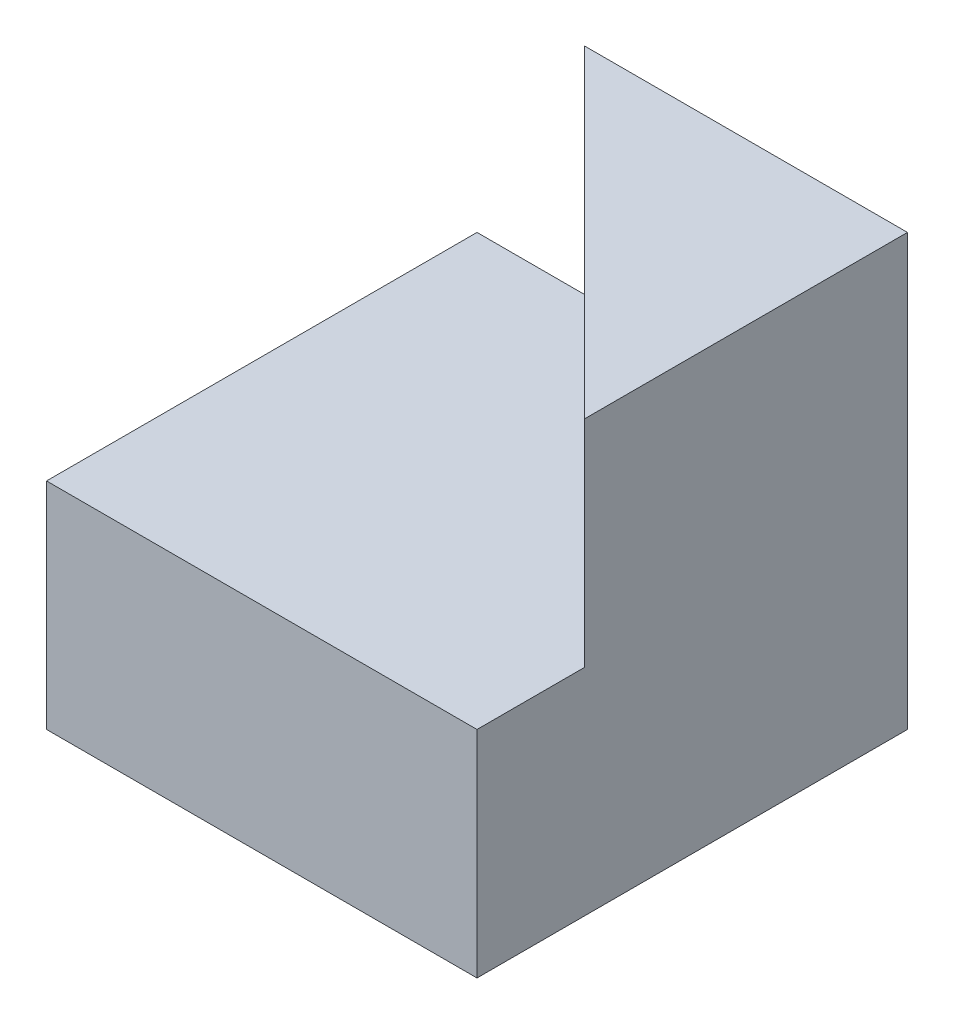
ISO-10303-21;
HEADER;
FILE_DESCRIPTION(('STEP AP214'),'2;1');
FILE_NAME('part.step','',(''),(''),'','','');
FILE_SCHEMA(('AUTOMOTIVE_DESIGN { 1 0 10303 214 1 1 1 1 }'));
ENDSEC;
DATA;
#1=APPLICATION_CONTEXT('core data for automotive mechanical design processes');
#2=APPLICATION_PROTOCOL_DEFINITION('international standard','automotive_design',2000,#1);
#3=PRODUCT_CONTEXT('',#1,'mechanical');
#4=PRODUCT('Part','Part','',(#3));
#5=PRODUCT_RELATED_PRODUCT_CATEGORY('part','',(#4));
#6=PRODUCT_DEFINITION_FORMATION('','',#4);
#7=PRODUCT_DEFINITION_CONTEXT('part definition',#1,'design');
#8=PRODUCT_DEFINITION('design','',#6,#7);
#9=PRODUCT_DEFINITION_SHAPE('','',#8);
#10=(LENGTH_UNIT() NAMED_UNIT(*) SI_UNIT(.MILLI.,.METRE.));
#11=(NAMED_UNIT(*) PLANE_ANGLE_UNIT() SI_UNIT($,.RADIAN.));
#12=(NAMED_UNIT(*) SI_UNIT($,.STERADIAN.) SOLID_ANGLE_UNIT());
#13=UNCERTAINTY_MEASURE_WITH_UNIT(LENGTH_MEASURE(1.E-05),#10,'distance_accuracy_value','');
#14=(GEOMETRIC_REPRESENTATION_CONTEXT(3) GLOBAL_UNCERTAINTY_ASSIGNED_CONTEXT((#13)) GLOBAL_UNIT_ASSIGNED_CONTEXT((#10,
#11,#12)) REPRESENTATION_CONTEXT('',''));
#15=CARTESIAN_POINT('',(0.,0.,0.));
#16=DIRECTION('',(0.,0.,1.));
#17=DIRECTION('',(1.,0.,0.));
#18=AXIS2_PLACEMENT_3D('',#15,#16,#17);
#19=CARTESIAN_POINT('',(40.,0.,40.));
#20=DIRECTION('',(-1.,0.,0.));
#21=DIRECTION('',(0.,0.,1.));
#22=AXIS2_PLACEMENT_3D('',#19,#20,#21);
#23=PLANE('',#22);
#24=DIRECTION('',(0.,1.,0.));
#25=VECTOR('',#24,1.);
#26=CARTESIAN_POINT('',(40.,20.,30.));
#27=LINE('',#26,#25);
#28=CARTESIAN_POINT('',(40.,20.,30.));
#29=VERTEX_POINT('',#28);
#30=CARTESIAN_POINT('',(40.,40.,30.));
#31=VERTEX_POINT('',#30);
#32=EDGE_CURVE('E115',#29,#31,#27,.T.);
#33=ORIENTED_EDGE('',*,*,#32,.F.);
#34=DIRECTION('',(0.,0.,-1.));
#35=VECTOR('',#34,1.);
#36=CARTESIAN_POINT('',(40.,20.,0.));
#37=LINE('',#36,#35);
#38=CARTESIAN_POINT('',(40.,20.,40.));
#39=VERTEX_POINT('',#38);
#40=EDGE_CURVE('E120',#39,#29,#37,.T.);
#41=ORIENTED_EDGE('',*,*,#40,.F.);
#42=DIRECTION('',(0.,1.,0.));
#43=VECTOR('',#42,1.);
#44=CARTESIAN_POINT('',(40.,0.,40.));
#45=LINE('',#44,#43);
#46=CARTESIAN_POINT('',(40.,0.,40.));
#47=VERTEX_POINT('',#46);
#48=EDGE_CURVE('E85',#47,#39,#45,.T.);
#49=ORIENTED_EDGE('',*,*,#48,.F.);
#50=DIRECTION('',(0.,0.,-1.));
#51=VECTOR('',#50,1.);
#52=CARTESIAN_POINT('',(40.,0.,40.));
#53=LINE('',#52,#51);
#54=CARTESIAN_POINT('',(40.,0.,0.));
#55=VERTEX_POINT('',#54);
#56=EDGE_CURVE('E41',#47,#55,#53,.T.);
#57=ORIENTED_EDGE('',*,*,#56,.T.);
#58=DIRECTION('',(0.,1.,0.));
#59=VECTOR('',#58,1.);
#60=CARTESIAN_POINT('',(40.,0.,0.));
#61=LINE('',#60,#59);
#62=CARTESIAN_POINT('',(40.,40.,0.));
#63=VERTEX_POINT('',#62);
#64=EDGE_CURVE('E89',#55,#63,#61,.T.);
#65=ORIENTED_EDGE('',*,*,#64,.T.);
#66=DIRECTION('',(0.,0.,-1.));
#67=VECTOR('',#66,1.);
#68=CARTESIAN_POINT('',(40.,40.,40.));
#69=LINE('',#68,#67);
#70=EDGE_CURVE('E74',#31,#63,#69,.T.);
#71=ORIENTED_EDGE('',*,*,#70,.F.);
#72=EDGE_LOOP('',(#33,#41,#49,#57,#65,#71));
#73=FACE_BOUND('',#72,.T.);
#74=ADVANCED_FACE('F33',(#73),#23,.F.);
#75=CARTESIAN_POINT('',(0.,40.,40.));
#76=DIRECTION('',(0.,-1.,0.));
#77=DIRECTION('',(0.,0.,-1.));
#78=AXIS2_PLACEMENT_3D('',#75,#76,#77);
#79=PLANE('',#78);
#80=DIRECTION('',(0.707106781186548,0.,0.707106781186548));
#81=VECTOR('',#80,1.);
#82=CARTESIAN_POINT('',(5.,40.,-5.));
#83=LINE('',#82,#81);
#84=CARTESIAN_POINT('',(10.,40.,0.));
#85=VERTEX_POINT('',#84);
#86=EDGE_CURVE('E82',#85,#31,#83,.T.);
#87=ORIENTED_EDGE('',*,*,#86,.T.);
#88=ORIENTED_EDGE('',*,*,#70,.T.);
#89=DIRECTION('',(-1.,0.,0.));
#90=VECTOR('',#89,1.);
#91=CARTESIAN_POINT('',(0.,40.,0.));
#92=LINE('',#91,#90);
#93=EDGE_CURVE('E79',#63,#85,#92,.T.);
#94=ORIENTED_EDGE('',*,*,#93,.T.);
#95=EDGE_LOOP('',(#87,#88,#94));
#96=FACE_BOUND('',#95,.T.);
#97=ADVANCED_FACE('F76',(#96),#79,.F.);
#98=CARTESIAN_POINT('',(0.,0.,40.));
#99=DIRECTION('',(0.,0.,-1.));
#100=DIRECTION('',(-1.,0.,0.));
#101=AXIS2_PLACEMENT_3D('',#98,#99,#100);
#102=PLANE('',#101);
#103=ORIENTED_EDGE('',*,*,#48,.T.);
#104=DIRECTION('',(1.,0.,0.));
#105=VECTOR('',#104,1.);
#106=CARTESIAN_POINT('',(0.,20.,40.));
#107=LINE('',#106,#105);
#108=CARTESIAN_POINT('',(0.,20.,40.));
#109=VERTEX_POINT('',#108);
#110=EDGE_CURVE('E111',#109,#39,#107,.T.);
#111=ORIENTED_EDGE('',*,*,#110,.F.);
#112=DIRECTION('',(0.,-1.,0.));
#113=VECTOR('',#112,1.);
#114=CARTESIAN_POINT('',(0.,0.,40.));
#115=LINE('',#114,#113);
#116=CARTESIAN_POINT('',(0.,0.,40.));
#117=VERTEX_POINT('',#116);
#118=EDGE_CURVE('E99',#109,#117,#115,.T.);
#119=ORIENTED_EDGE('',*,*,#118,.T.);
#120=DIRECTION('',(1.,0.,0.));
#121=VECTOR('',#120,1.);
#122=CARTESIAN_POINT('',(0.,0.,40.));
#123=LINE('',#122,#121);
#124=EDGE_CURVE('E57',#117,#47,#123,.T.);
#125=ORIENTED_EDGE('',*,*,#124,.T.);
#126=EDGE_LOOP('',(#103,#111,#119,#125));
#127=FACE_BOUND('',#126,.T.);
#128=ADVANCED_FACE('F133',(#127),#102,.F.);
#129=CARTESIAN_POINT('',(0.,0.,40.));
#130=DIRECTION('',(1.,0.,0.));
#131=DIRECTION('',(0.,0.,-1.));
#132=AXIS2_PLACEMENT_3D('',#129,#130,#131);
#133=PLANE('',#132);
#134=ORIENTED_EDGE('',*,*,#118,.F.);
#135=DIRECTION('',(0.,0.,1.));
#136=VECTOR('',#135,1.);
#137=CARTESIAN_POINT('',(0.,20.,0.));
#138=LINE('',#137,#136);
#139=CARTESIAN_POINT('',(0.,20.,0.));
#140=VERTEX_POINT('',#139);
#141=EDGE_CURVE('E106',#140,#109,#138,.T.);
#142=ORIENTED_EDGE('',*,*,#141,.F.);
#143=DIRECTION('',(0.,-1.,0.));
#144=VECTOR('',#143,1.);
#145=CARTESIAN_POINT('',(0.,0.,0.));
#146=LINE('',#145,#144);
#147=CARTESIAN_POINT('',(0.,0.,0.));
#148=VERTEX_POINT('',#147);
#149=EDGE_CURVE('E104',#140,#148,#146,.T.);
#150=ORIENTED_EDGE('',*,*,#149,.T.);
#151=DIRECTION('',(0.,0.,-1.));
#152=VECTOR('',#151,1.);
#153=CARTESIAN_POINT('',(0.,0.,40.));
#154=LINE('',#153,#152);
#155=EDGE_CURVE('E11',#117,#148,#154,.T.);
#156=ORIENTED_EDGE('',*,*,#155,.F.);
#157=EDGE_LOOP('',(#134,#142,#150,#156));
#158=FACE_BOUND('',#157,.T.);
#159=ADVANCED_FACE('F35',(#158),#133,.F.);
#160=CARTESIAN_POINT('',(0.,0.,40.));
#161=DIRECTION('',(0.,1.,0.));
#162=DIRECTION('',(0.,0.,1.));
#163=AXIS2_PLACEMENT_3D('',#160,#161,#162);
#164=PLANE('',#163);
#165=DIRECTION('',(1.,0.,0.));
#166=VECTOR('',#165,1.);
#167=CARTESIAN_POINT('',(0.,0.,0.));
#168=LINE('',#167,#166);
#169=EDGE_CURVE('E93',#148,#55,#168,.T.);
#170=ORIENTED_EDGE('',*,*,#169,.T.);
#171=ORIENTED_EDGE('',*,*,#56,.F.);
#172=ORIENTED_EDGE('',*,*,#124,.F.);
#173=ORIENTED_EDGE('',*,*,#155,.T.);
#174=EDGE_LOOP('',(#170,#171,#172,#173));
#175=FACE_BOUND('',#174,.T.);
#176=ADVANCED_FACE('F140',(#175),#164,.F.);
#177=CARTESIAN_POINT('',(0.,0.,0.));
#178=DIRECTION('',(0.,0.,-1.));
#179=DIRECTION('',(-1.,0.,0.));
#180=AXIS2_PLACEMENT_3D('',#177,#178,#179);
#181=PLANE('',#180);
#182=DIRECTION('',(0.,1.,0.));
#183=VECTOR('',#182,1.);
#184=CARTESIAN_POINT('',(10.,40.,0.));
#185=LINE('',#184,#183);
#186=CARTESIAN_POINT('',(10.,20.,0.));
#187=VERTEX_POINT('',#186);
#188=EDGE_CURVE('E98',#187,#85,#185,.T.);
#189=ORIENTED_EDGE('',*,*,#188,.T.);
#190=ORIENTED_EDGE('',*,*,#93,.F.);
#191=ORIENTED_EDGE('',*,*,#64,.F.);
#192=ORIENTED_EDGE('',*,*,#169,.F.);
#193=ORIENTED_EDGE('',*,*,#149,.F.);
#194=DIRECTION('',(1.,0.,0.));
#195=VECTOR('',#194,1.);
#196=CARTESIAN_POINT('',(0.,20.,0.));
#197=LINE('',#196,#195);
#198=EDGE_CURVE('E114',#140,#187,#197,.T.);
#199=ORIENTED_EDGE('',*,*,#198,.T.);
#200=EDGE_LOOP('',(#189,#190,#191,#192,#193,#199));
#201=FACE_BOUND('',#200,.T.);
#202=ADVANCED_FACE('F96',(#201),#181,.T.);
#203=CARTESIAN_POINT('',(0.,20.,0.));
#204=DIRECTION('',(0.,-1.,0.));
#205=DIRECTION('',(0.,0.,-1.));
#206=AXIS2_PLACEMENT_3D('',#203,#204,#205);
#207=PLANE('',#206);
#208=ORIENTED_EDGE('',*,*,#110,.T.);
#209=ORIENTED_EDGE('',*,*,#40,.T.);
#210=DIRECTION('',(0.707106781186548,0.,0.707106781186548));
#211=VECTOR('',#210,1.);
#212=CARTESIAN_POINT('',(5.,20.,-5.));
#213=LINE('',#212,#211);
#214=EDGE_CURVE('E48',#187,#29,#213,.T.);
#215=ORIENTED_EDGE('',*,*,#214,.F.);
#216=ORIENTED_EDGE('',*,*,#198,.F.);
#217=ORIENTED_EDGE('',*,*,#141,.T.);
#218=EDGE_LOOP('',(#208,#209,#215,#216,#217));
#219=FACE_BOUND('',#218,.T.);
#220=ADVANCED_FACE('F130',(#219),#207,.F.);
#221=CARTESIAN_POINT('',(5.,20.,-5.));
#222=DIRECTION('',(-0.707106781186548,0.,0.707106781186548));
#223=DIRECTION('',(0.707106781186548,0.,0.707106781186548));
#224=AXIS2_PLACEMENT_3D('',#221,#222,#223);
#225=PLANE('',#224);
#226=ORIENTED_EDGE('',*,*,#86,.F.);
#227=ORIENTED_EDGE('',*,*,#188,.F.);
#228=ORIENTED_EDGE('',*,*,#214,.T.);
#229=ORIENTED_EDGE('',*,*,#32,.T.);
#230=EDGE_LOOP('',(#226,#227,#228,#229));
#231=FACE_BOUND('',#230,.T.);
#232=ADVANCED_FACE('F125',(#231),#225,.T.);
#233=CLOSED_SHELL('',(#74,#97,#128,#159,#176,#202,#220,#232));
#234=MANIFOLD_SOLID_BREP('B2',#233);
#235=ADVANCED_BREP_SHAPE_REPRESENTATION('',(#18,#234),#14);
#236=SHAPE_DEFINITION_REPRESENTATION(#9,#235);
ENDSEC;
END-ISO-10303-21;
